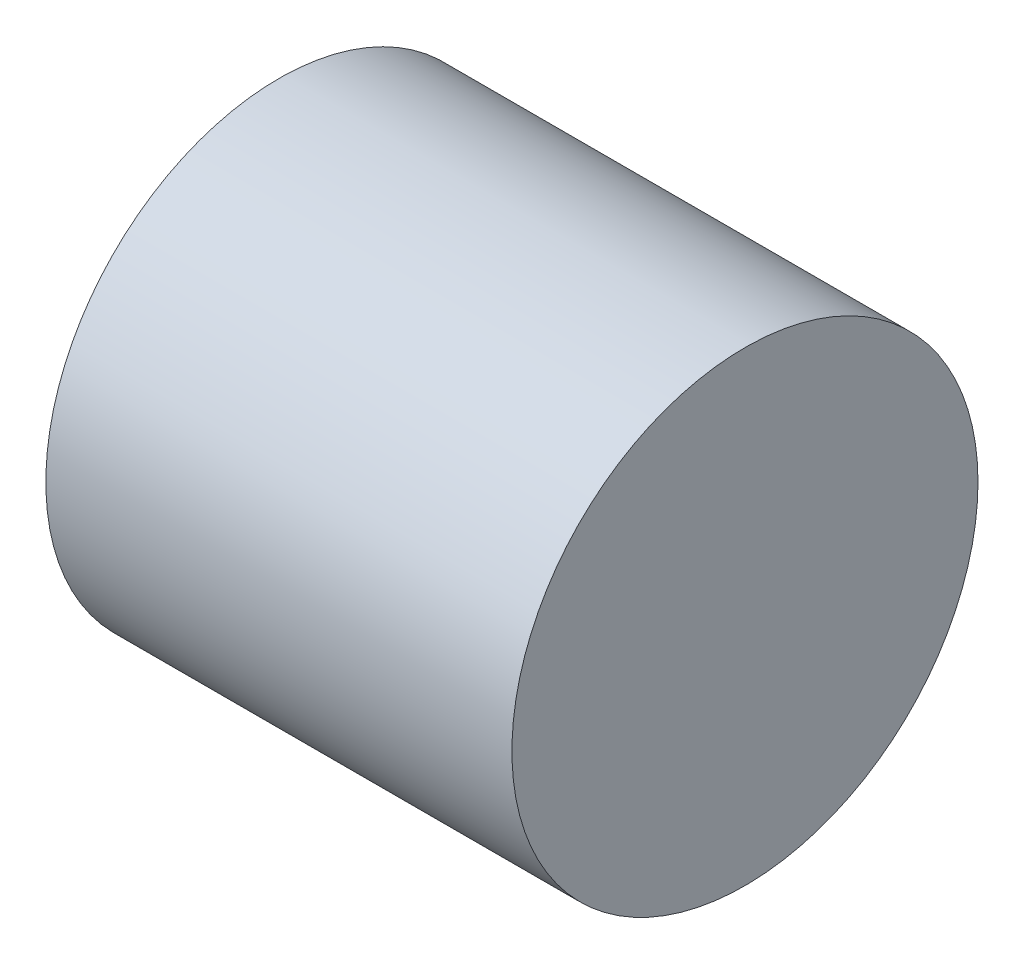
ISO-10303-21;
HEADER;
FILE_DESCRIPTION(('STEP AP214'),'2;1');
FILE_NAME('part.step','',(''),(''),'','','');
FILE_SCHEMA(('AUTOMOTIVE_DESIGN { 1 0 10303 214 1 1 1 1 }'));
ENDSEC;
DATA;
#1=APPLICATION_CONTEXT('core data for automotive mechanical design processes');
#2=APPLICATION_PROTOCOL_DEFINITION('international standard','automotive_design',2000,#1);
#3=PRODUCT_CONTEXT('',#1,'mechanical');
#4=PRODUCT('Part','Part','',(#3));
#5=PRODUCT_RELATED_PRODUCT_CATEGORY('part','',(#4));
#6=PRODUCT_DEFINITION_FORMATION('','',#4);
#7=PRODUCT_DEFINITION_CONTEXT('part definition',#1,'design');
#8=PRODUCT_DEFINITION('design','',#6,#7);
#9=PRODUCT_DEFINITION_SHAPE('','',#8);
#10=(LENGTH_UNIT() NAMED_UNIT(*) SI_UNIT(.MILLI.,.METRE.));
#11=(NAMED_UNIT(*) PLANE_ANGLE_UNIT() SI_UNIT($,.RADIAN.));
#12=(NAMED_UNIT(*) SI_UNIT($,.STERADIAN.) SOLID_ANGLE_UNIT());
#13=UNCERTAINTY_MEASURE_WITH_UNIT(LENGTH_MEASURE(1.E-05),#10,'distance_accuracy_value','');
#14=(GEOMETRIC_REPRESENTATION_CONTEXT(3) GLOBAL_UNCERTAINTY_ASSIGNED_CONTEXT((#13)) GLOBAL_UNIT_ASSIGNED_CONTEXT((#10,
#11,#12)) REPRESENTATION_CONTEXT('',''));
#15=CARTESIAN_POINT('',(0.,0.,0.));
#16=DIRECTION('',(0.,0.,1.));
#17=DIRECTION('',(1.,0.,0.));
#18=AXIS2_PLACEMENT_3D('',#15,#16,#17);
#19=CARTESIAN_POINT('',(20.,0.,0.));
#20=DIRECTION('',(-1.,0.,0.));
#21=DIRECTION('',(0.,0.,1.));
#22=AXIS2_PLACEMENT_3D('',#19,#20,#21);
#23=CYLINDRICAL_SURFACE('',#22,10.);
#24=CARTESIAN_POINT('',(20.,0.,0.));
#25=DIRECTION('',(1.,0.,0.));
#26=DIRECTION('',(0.,0.,-1.));
#27=AXIS2_PLACEMENT_3D('',#24,#25,#26);
#28=CIRCLE('',#27,10.);
#29=CARTESIAN_POINT('',(20.,0.,-10.));
#30=VERTEX_POINT('',#29);
#31=EDGE_CURVE('E11',#30,#30,#28,.T.);
#32=ORIENTED_EDGE('',*,*,#31,.F.);
#33=EDGE_LOOP('',(#32));
#34=FACE_BOUND('',#33,.T.);
#35=CARTESIAN_POINT('',(0.,0.,0.));
#36=DIRECTION('',(1.,0.,0.));
#37=DIRECTION('',(0.,0.,-1.));
#38=AXIS2_PLACEMENT_3D('',#35,#36,#37);
#39=CIRCLE('',#38,10.);
#40=CARTESIAN_POINT('',(0.,0.,-10.));
#41=VERTEX_POINT('',#40);
#42=EDGE_CURVE('E35',#41,#41,#39,.T.);
#43=ORIENTED_EDGE('',*,*,#42,.T.);
#44=EDGE_LOOP('',(#43));
#45=FACE_BOUND('',#44,.T.);
#46=ADVANCED_FACE('F32',(#34,#45),#23,.T.);
#47=CARTESIAN_POINT('',(20.,0.,0.));
#48=DIRECTION('',(1.,0.,0.));
#49=DIRECTION('',(0.,0.,-1.));
#50=AXIS2_PLACEMENT_3D('',#47,#48,#49);
#51=PLANE('',#50);
#52=ORIENTED_EDGE('',*,*,#31,.T.);
#53=EDGE_LOOP('',(#52));
#54=FACE_BOUND('',#53,.T.);
#55=ADVANCED_FACE('F85',(#54),#51,.T.);
#56=CARTESIAN_POINT('',(0.,0.,0.));
#57=DIRECTION('',(1.,0.,0.));
#58=DIRECTION('',(0.,0.,-1.));
#59=AXIS2_PLACEMENT_3D('',#56,#57,#58);
#60=PLANE('',#59);
#61=DIRECTION('',(0.,0.,-1.));
#62=VECTOR('',#61,1.);
#63=CARTESIAN_POINT('',(0.,2.,-2.23606797749979));
#64=LINE('',#63,#62);
#65=CARTESIAN_POINT('',(0.,2.,2.23606797749979));
#66=VERTEX_POINT('',#65);
#67=CARTESIAN_POINT('',(0.,2.,-2.23606797749979));
#68=VERTEX_POINT('',#67);
#69=EDGE_CURVE('E65',#66,#68,#64,.T.);
#70=ORIENTED_EDGE('',*,*,#69,.F.);
#71=CARTESIAN_POINT('',(0.,0.,0.));
#72=DIRECTION('',(-1.,0.,0.));
#73=DIRECTION('',(0.,0.,1.));
#74=AXIS2_PLACEMENT_3D('',#71,#72,#73);
#75=CIRCLE('',#74,3.);
#76=EDGE_CURVE('E46',#68,#66,#75,.T.);
#77=ORIENTED_EDGE('',*,*,#76,.F.);
#78=EDGE_LOOP('',(#70,#77));
#79=FACE_BOUND('',#78,.T.);
#80=ORIENTED_EDGE('',*,*,#42,.F.);
#81=EDGE_LOOP('',(#80));
#82=FACE_BOUND('',#81,.T.);
#83=ADVANCED_FACE('F69',(#79,#82),#60,.F.);
#84=CARTESIAN_POINT('',(10.,0.,0.));
#85=DIRECTION('',(-1.,0.,0.));
#86=DIRECTION('',(0.,0.,1.));
#87=AXIS2_PLACEMENT_3D('',#84,#85,#86);
#88=CYLINDRICAL_SURFACE('',#87,3.);
#89=ORIENTED_EDGE('',*,*,#76,.T.);
#90=DIRECTION('',(-1.,0.,0.));
#91=VECTOR('',#90,1.);
#92=CARTESIAN_POINT('',(10.,2.,2.23606797749979));
#93=LINE('',#92,#91);
#94=CARTESIAN_POINT('',(10.,2.,2.23606797749979));
#95=VERTEX_POINT('',#94);
#96=EDGE_CURVE('E62',#95,#66,#93,.T.);
#97=ORIENTED_EDGE('',*,*,#96,.F.);
#98=CARTESIAN_POINT('',(10.,0.,0.));
#99=DIRECTION('',(-1.,0.,0.));
#100=DIRECTION('',(0.,0.,1.));
#101=AXIS2_PLACEMENT_3D('',#98,#99,#100);
#102=CIRCLE('',#101,3.);
#103=CARTESIAN_POINT('',(10.,2.,-2.23606797749979));
#104=VERTEX_POINT('',#103);
#105=EDGE_CURVE('E60',#104,#95,#102,.T.);
#106=ORIENTED_EDGE('',*,*,#105,.F.);
#107=DIRECTION('',(-1.,0.,0.));
#108=VECTOR('',#107,1.);
#109=CARTESIAN_POINT('',(10.,2.,-2.23606797749979));
#110=LINE('',#109,#108);
#111=EDGE_CURVE('E54',#104,#68,#110,.T.);
#112=ORIENTED_EDGE('',*,*,#111,.T.);
#113=EDGE_LOOP('',(#89,#97,#106,#112));
#114=FACE_BOUND('',#113,.T.);
#115=ADVANCED_FACE('F58',(#114),#88,.F.);
#116=CARTESIAN_POINT('',(10.,2.,-2.23606797749979));
#117=DIRECTION('',(0.,1.,0.));
#118=DIRECTION('',(0.,0.,1.));
#119=AXIS2_PLACEMENT_3D('',#116,#117,#118);
#120=PLANE('',#119);
#121=ORIENTED_EDGE('',*,*,#69,.T.);
#122=ORIENTED_EDGE('',*,*,#111,.F.);
#123=DIRECTION('',(0.,0.,-1.));
#124=VECTOR('',#123,1.);
#125=CARTESIAN_POINT('',(10.,2.,-2.23606797749979));
#126=LINE('',#125,#124);
#127=EDGE_CURVE('E73',#95,#104,#126,.T.);
#128=ORIENTED_EDGE('',*,*,#127,.F.);
#129=ORIENTED_EDGE('',*,*,#96,.T.);
#130=EDGE_LOOP('',(#121,#122,#128,#129));
#131=FACE_BOUND('',#130,.T.);
#132=ADVANCED_FACE('F66',(#131),#120,.F.);
#133=CARTESIAN_POINT('',(10.,0.,0.));
#134=DIRECTION('',(-1.,0.,0.));
#135=DIRECTION('',(0.,0.,1.));
#136=AXIS2_PLACEMENT_3D('',#133,#134,#135);
#137=PLANE('',#136);
#138=ORIENTED_EDGE('',*,*,#105,.T.);
#139=ORIENTED_EDGE('',*,*,#127,.T.);
#140=EDGE_LOOP('',(#138,#139));
#141=FACE_BOUND('',#140,.T.);
#142=ADVANCED_FACE('F77',(#141),#137,.T.);
#143=CLOSED_SHELL('',(#46,#55,#83,#115,#132,#142));
#144=MANIFOLD_SOLID_BREP('B2',#143);
#145=ADVANCED_BREP_SHAPE_REPRESENTATION('',(#18,#144),#14);
#146=SHAPE_DEFINITION_REPRESENTATION(#9,#145);
ENDSEC;
END-ISO-10303-21;
